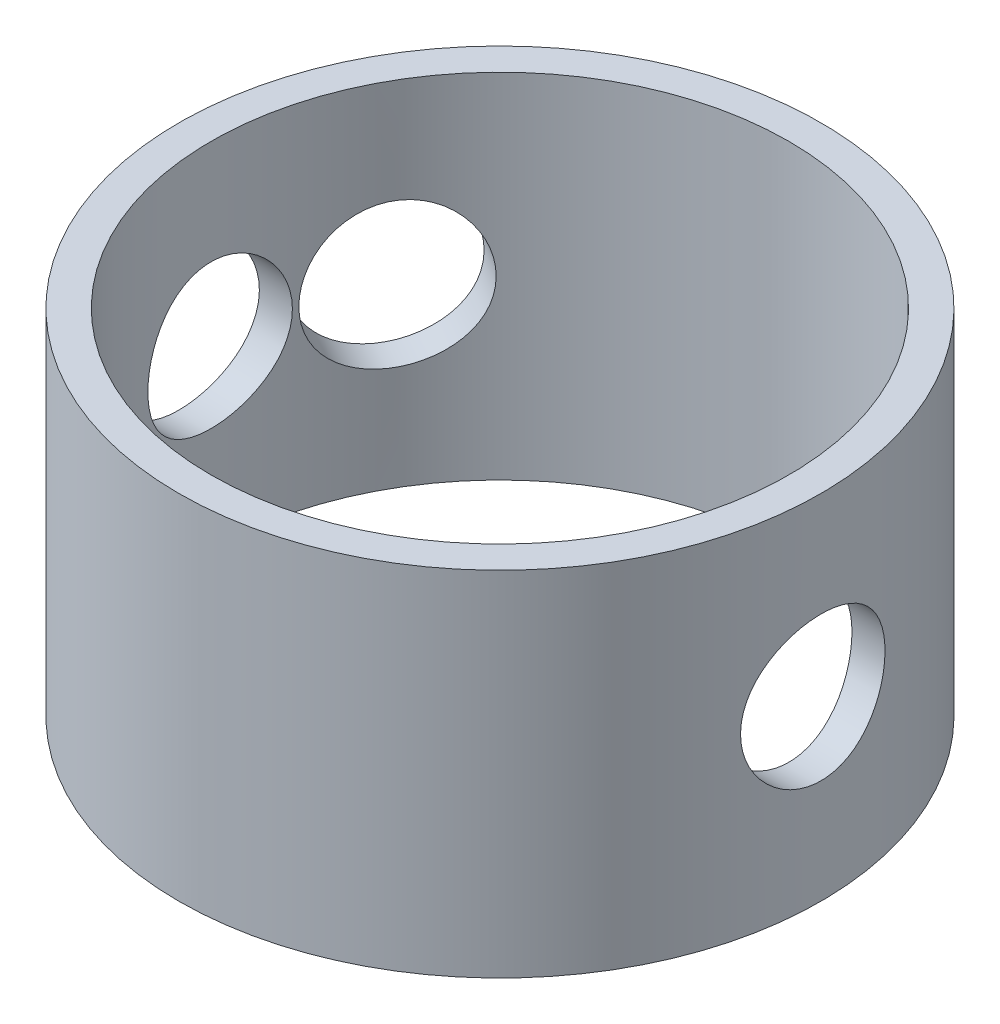
ISO-10303-21;
HEADER;
FILE_DESCRIPTION(('STEP AP214'),'2;1');
FILE_NAME('part.step','',(''),(''),'','','');
FILE_SCHEMA(('AUTOMOTIVE_DESIGN { 1 0 10303 214 1 1 1 1 }'));
ENDSEC;
DATA;
#1=APPLICATION_CONTEXT('core data for automotive mechanical design processes');
#2=APPLICATION_PROTOCOL_DEFINITION('international standard','automotive_design',2000,#1);
#3=PRODUCT_CONTEXT('',#1,'mechanical');
#4=PRODUCT('Part','Part','',(#3));
#5=PRODUCT_RELATED_PRODUCT_CATEGORY('part','',(#4));
#6=PRODUCT_DEFINITION_FORMATION('','',#4);
#7=PRODUCT_DEFINITION_CONTEXT('part definition',#1,'design');
#8=PRODUCT_DEFINITION('design','',#6,#7);
#9=PRODUCT_DEFINITION_SHAPE('','',#8);
#10=(LENGTH_UNIT() NAMED_UNIT(*) SI_UNIT(.MILLI.,.METRE.));
#11=(NAMED_UNIT(*) PLANE_ANGLE_UNIT() SI_UNIT($,.RADIAN.));
#12=(NAMED_UNIT(*) SI_UNIT($,.STERADIAN.) SOLID_ANGLE_UNIT());
#13=UNCERTAINTY_MEASURE_WITH_UNIT(LENGTH_MEASURE(1.E-05),#10,'distance_accuracy_value','');
#14=(GEOMETRIC_REPRESENTATION_CONTEXT(3) GLOBAL_UNCERTAINTY_ASSIGNED_CONTEXT((#13)) GLOBAL_UNIT_ASSIGNED_CONTEXT((#10,
#11,#12)) REPRESENTATION_CONTEXT('',''));
#15=CARTESIAN_POINT('',(0.,0.,0.));
#16=DIRECTION('',(0.,0.,1.));
#17=DIRECTION('',(1.,0.,0.));
#18=AXIS2_PLACEMENT_3D('',#15,#16,#17);
#19=CARTESIAN_POINT('',(0.,5.5,0.));
#20=DIRECTION('',(0.,1.,0.));
#21=DIRECTION('',(0.,0.,1.));
#22=AXIS2_PLACEMENT_3D('',#19,#20,#21);
#23=PLANE('',#22);
#24=CARTESIAN_POINT('',(0.,5.5,0.));
#25=DIRECTION('',(0.,1.,0.));
#26=DIRECTION('',(0.,0.,1.));
#27=AXIS2_PLACEMENT_3D('',#24,#25,#26);
#28=CIRCLE('',#27,10.);
#29=CARTESIAN_POINT('',(0.,5.5,10.));
#30=VERTEX_POINT('',#29);
#31=EDGE_CURVE('E10',#30,#30,#28,.T.);
#32=ORIENTED_EDGE('',*,*,#31,.T.);
#33=EDGE_LOOP('',(#32));
#34=FACE_BOUND('',#33,.T.);
#35=CARTESIAN_POINT('',(0.,5.5,0.));
#36=DIRECTION('',(0.,1.,0.));
#37=DIRECTION('',(0.,0.,1.));
#38=AXIS2_PLACEMENT_3D('',#35,#36,#37);
#39=CIRCLE('',#38,9.);
#40=CARTESIAN_POINT('',(0.,5.5,9.));
#41=VERTEX_POINT('',#40);
#42=EDGE_CURVE('E49',#41,#41,#39,.T.);
#43=ORIENTED_EDGE('',*,*,#42,.F.);
#44=EDGE_LOOP('',(#43));
#45=FACE_BOUND('',#44,.T.);
#46=ADVANCED_FACE('F31',(#34,#45),#23,.T.);
#47=CARTESIAN_POINT('',(0.,-5.5,0.));
#48=DIRECTION('',(0.,1.,0.));
#49=DIRECTION('',(0.,0.,1.));
#50=AXIS2_PLACEMENT_3D('',#47,#48,#49);
#51=PLANE('',#50);
#52=CARTESIAN_POINT('',(0.,-5.5,0.));
#53=DIRECTION('',(0.,1.,0.));
#54=DIRECTION('',(0.,0.,1.));
#55=AXIS2_PLACEMENT_3D('',#52,#53,#54);
#56=CIRCLE('',#55,10.);
#57=CARTESIAN_POINT('',(0.,-5.5,10.));
#58=VERTEX_POINT('',#57);
#59=EDGE_CURVE('E44',#58,#58,#56,.T.);
#60=ORIENTED_EDGE('',*,*,#59,.F.);
#61=EDGE_LOOP('',(#60));
#62=FACE_BOUND('',#61,.T.);
#63=CARTESIAN_POINT('',(0.,-5.5,0.));
#64=DIRECTION('',(0.,1.,0.));
#65=DIRECTION('',(0.,0.,1.));
#66=AXIS2_PLACEMENT_3D('',#63,#64,#65);
#67=CIRCLE('',#66,9.);
#68=CARTESIAN_POINT('',(0.,-5.5,9.));
#69=VERTEX_POINT('',#68);
#70=EDGE_CURVE('E52',#69,#69,#67,.T.);
#71=ORIENTED_EDGE('',*,*,#70,.T.);
#72=EDGE_LOOP('',(#71));
#73=FACE_BOUND('',#72,.T.);
#74=ADVANCED_FACE('F107',(#62,#73),#51,.F.);
#75=CARTESIAN_POINT('',(0.,5.5,0.));
#76=DIRECTION('',(0.,-1.,0.));
#77=DIRECTION('',(0.,0.,-1.));
#78=AXIS2_PLACEMENT_3D('',#75,#76,#77);
#79=CYLINDRICAL_SURFACE('',#78,10.);
#80=CARTESIAN_POINT('',(-10.,-2.25,0.));
#81=CARTESIAN_POINT('',(-9.99999771694518,-2.24999587078108,-0.124699980173304));
#82=CARTESIAN_POINT('',(-9.99764387141181,-2.2395982953768,-0.249449090211301));
#83=CARTESIAN_POINT('',(-9.9884813966466,-2.19832951041739,-0.495397749746435));
#84=CARTESIAN_POINT('',(-9.9816697099651,-2.16744424900414,-0.616594803385697));
#85=CARTESIAN_POINT('',(-9.96434919694451,-2.08622125907406,-0.851849872654528));
#86=CARTESIAN_POINT('',(-9.95384434542968,-2.0359044383554,-0.965915408843231));
#87=CARTESIAN_POINT('',(-9.93026839001207,-1.91731441158288,-1.18398243160764));
#88=CARTESIAN_POINT('',(-9.91719732262225,-1.84904146101007,-1.28798406134451));
#89=CARTESIAN_POINT('',(-9.88967110046879,-1.69525502679128,-1.48473408395884));
#90=CARTESIAN_POINT('',(-9.87519795610526,-1.60949570009561,-1.57728781649952));
#91=CARTESIAN_POINT('',(-9.8466241340422,-1.42369841608187,-1.74682611866484));
#92=CARTESIAN_POINT('',(-9.83252349122492,-1.32365912711958,-1.82380923466833));
#93=CARTESIAN_POINT('',(-9.80611312139272,-1.1106886380241,-1.96089062994942));
#94=CARTESIAN_POINT('',(-9.79382640798822,-0.997619652513677,-2.0207796762197));
#95=CARTESIAN_POINT('',(-9.77269409851722,-0.762699838887984,-2.12063014285829));
#96=CARTESIAN_POINT('',(-9.7638480651916,-0.640850129006192,-2.16059409559087));
#97=CARTESIAN_POINT('',(-9.75078225790901,-0.393945077725128,-2.2188126339931));
#98=CARTESIAN_POINT('',(-9.74648890346122,-0.268975229377931,-2.237412923577));
#99=CARTESIAN_POINT('',(-9.74279372340889,-0.0176207324970899,-2.25345144263654));
#100=CARTESIAN_POINT('',(-9.74339126020144,0.108763729474717,-2.25089243055212));
#101=CARTESIAN_POINT('',(-9.7493438221449,0.35677500839379,-2.22496273321229));
#102=CARTESIAN_POINT('',(-9.75460659824395,0.478446565475752,-2.20199557166843));
#103=CARTESIAN_POINT('',(-9.76915058701734,0.716164082748739,-2.13654167024627));
#104=CARTESIAN_POINT('',(-9.77843203686247,0.832209710463741,-2.0940537783005));
#105=CARTESIAN_POINT('',(-9.80005729379312,1.05650562440403,-1.99039912002163));
#106=CARTESIAN_POINT('',(-9.8124261019186,1.16468246903344,-1.92907886854504));
#107=CARTESIAN_POINT('',(-9.83881732813755,1.36935943001856,-1.78960795010145));
#108=CARTESIAN_POINT('',(-9.85283998387547,1.46585786423543,-1.71145486305659));
#109=CARTESIAN_POINT('',(-9.88135331942439,1.64676002262606,-1.53840941447694));
#110=CARTESIAN_POINT('',(-9.89584735926513,1.73083578516287,-1.44317439868844));
#111=CARTESIAN_POINT('',(-9.92337817561626,1.88187798698242,-1.23979023032877));
#112=CARTESIAN_POINT('',(-9.93641492265959,1.94884408033572,-1.13164081671453));
#113=CARTESIAN_POINT('',(-9.9596085297879,2.06385442564537,-0.905084686036906));
#114=CARTESIAN_POINT('',(-9.96975853624758,2.11185375057136,-0.786654415509773));
#115=CARTESIAN_POINT('',(-9.98598436481004,2.18717808536306,-0.543129505070469));
#116=CARTESIAN_POINT('',(-9.99206081464266,2.21450628070668,-0.418035895178883));
#117=CARTESIAN_POINT('',(-9.99936485032445,2.24723107008369,-0.167546638635216));
#118=CARTESIAN_POINT('',(-10.0006914083681,2.25307538769192,-0.0422122904927544));
#119=CARTESIAN_POINT('',(-9.998624405112,2.24388280727281,0.207642012862522));
#120=CARTESIAN_POINT('',(-9.99523118361733,2.22884741250097,0.332162026055726));
#121=CARTESIAN_POINT('',(-9.98416853819685,2.17869311915451,0.575355741580678));
#122=CARTESIAN_POINT('',(-9.97654952458062,2.14381085342044,0.694080742417265));
#123=CARTESIAN_POINT('',(-9.95788891115751,2.05521709888024,0.9239935007677));
#124=CARTESIAN_POINT('',(-9.94684700837049,2.00150394318563,1.03518058999426));
#125=CARTESIAN_POINT('',(-9.92232244804704,1.87585280628475,1.24869945121971));
#126=CARTESIAN_POINT('',(-9.90880573869581,1.80365412939586,1.35087381002615));
#127=CARTESIAN_POINT('',(-9.8808971094203,1.64342272060557,1.5418171847585));
#128=CARTESIAN_POINT('',(-9.86650506892447,1.55538780407373,1.63058434803184));
#129=CARTESIAN_POINT('',(-9.83812317322868,1.36392321097715,1.79397825629388));
#130=CARTESIAN_POINT('',(-9.82414670937266,1.26022586804994,1.86829411913197));
#131=CARTESIAN_POINT('',(-9.79849887314339,1.04156031811999,1.99845908651711));
#132=CARTESIAN_POINT('',(-9.78682739936824,0.926592607260111,2.05430900349706));
#133=CARTESIAN_POINT('',(-9.76722644872885,0.689273282785766,2.1455693288797));
#134=CARTESIAN_POINT('',(-9.75927557489345,0.566968571315208,2.1810968796756));
#135=CARTESIAN_POINT('',(-9.74798028769131,0.317921950371438,2.23104191763122));
#136=CARTESIAN_POINT('',(-9.74463508800211,0.191180802116749,2.24546300830367));
#137=CARTESIAN_POINT('',(-9.74298148577602,-0.0600013089167236,2.25262552273881));
#138=CARTESIAN_POINT('',(-9.74455840453851,-0.184427692756016,2.24586054101785));
#139=CARTESIAN_POINT('',(-9.75231090038413,-0.430318309827299,2.2119514057036));
#140=CARTESIAN_POINT('',(-9.75848641660509,-0.551782582240692,2.18480752182386));
#141=CARTESIAN_POINT('',(-9.77468279684128,-0.787881404344379,2.11115577035663));
#142=CARTESIAN_POINT('',(-9.78468859473724,-0.902540705210114,2.06472371114527));
#143=CARTESIAN_POINT('',(-9.80742322558036,-1.12251375516475,1.95387734313721));
#144=CARTESIAN_POINT('',(-9.82015236098498,-1.22782646436923,1.88946103674367));
#145=CARTESIAN_POINT('',(-9.8472390229921,-1.4285411498367,1.74285474963165));
#146=CARTESIAN_POINT('',(-9.86162550918978,-1.52368358555722,1.66031472333599));
#147=CARTESIAN_POINT('',(-9.89021568200379,-1.69892877873713,1.48050834559761));
#148=CARTESIAN_POINT('',(-9.90441932543721,-1.77902804194522,1.38323858216312));
#149=CARTESIAN_POINT('',(-9.93127801911181,-1.92298363561255,1.17510318835927));
#150=CARTESIAN_POINT('',(-9.94390879221351,-1.9865986429252,1.06406732741539));
#151=CARTESIAN_POINT('',(-9.96595299275023,-2.0941606300921,0.832614984311326));
#152=CARTESIAN_POINT('',(-9.97536904379473,-2.13812365749292,0.712206250610561));
#153=CARTESIAN_POINT('',(-9.98829672089429,-2.19754384373666,0.493113147452931));
#154=CARTESIAN_POINT('',(-9.99265771842981,-2.21717645823927,0.395589687899849));
#155=CARTESIAN_POINT('',(-9.99851019685605,-2.24340585990937,0.198721159324828));
#156=CARTESIAN_POINT('',(-10.000001819417,-2.25000329066616,0.0993761804816512));
#157=CARTESIAN_POINT('',(-10.,-2.25,0.));
#158=B_SPLINE_CURVE_WITH_KNOTS('',3,(#80,#81,#82,#83,#84,#85,#86,#87,#88,#89,#90,#91,#92,#93,
#94,#95,#96,#97,#98,#99,#100,#101,#102,#103,#104,#105,#106,#107,#108,#109,#110,#111,#112,#113,
#114,#115,#116,#117,#118,#119,#120,#121,#122,#123,#124,#125,#126,#127,#128,#129,#130,#131,#132,
#133,#134,#135,#136,#137,#138,#139,#140,#141,#142,#143,#144,#145,#146,#147,#148,#149,#150,#151,
#152,#153,#154,#155,#156,#157),.UNSPECIFIED.,.T.,.F.,(4,2,2,2,2,2,2,2,2,2,2,2,2,2,2,2,2,2,2,2,2,
2,2,2,2,2,2,2,2,2,2,2,2,2,2,2,2,2,4),(0.,0.373736106234698,0.747728811688385,1.12132022791483,
1.49490632894446,1.87416011882319,2.2534492982533,2.63719933934683,3.02090059558661,
3.39830126943979,3.77565274409459,4.14570499983861,4.51577909800026,4.88895317842802,
5.26218094641699,5.64396439872406,6.02575556945528,6.40844575317233,6.79107695125827,
7.16568740644777,7.54027089258629,7.91047912717914,8.28072014045199,8.65650159427476,
9.03233492746191,9.41552668316496,9.79870157761228,10.1796449182611,10.5605232127409,
10.9325943469771,11.304660556961,11.6752780659135,12.0459367575248,12.4245075326659,
12.8031661343442,13.1870895339321,13.5706988514769,13.8685521516599,14.1663907454919),.UNSPECIFIED.);
#159=CARTESIAN_POINT('',(-10.,-2.25,0.));
#160=VERTEX_POINT('',#159);
#161=EDGE_CURVE('E79',#160,#160,#158,.T.);
#162=ORIENTED_EDGE('',*,*,#161,.T.);
#163=EDGE_LOOP('',(#162));
#164=FACE_BOUND('',#163,.T.);
#165=CARTESIAN_POINT('',(9.74358763495254,0.,-2.25));
#166=CARTESIAN_POINT('',(9.74359014970083,-0.12465493713428,-2.24999583947943));
#167=CARTESIAN_POINT('',(9.74600587019631,-0.249359079583871,-2.23960551864261));
#168=CARTESIAN_POINT('',(9.75538868577708,-0.495214406159011,-2.19836815743239));
#169=CARTESIAN_POINT('',(9.76235894789331,-0.616363056652703,-2.16750688221769));
#170=CARTESIAN_POINT('',(9.78002237082416,-0.851515548645589,-2.08635400208704));
#171=CARTESIAN_POINT('',(9.79071130914383,-0.965527321432348,-2.03608442789582));
#172=CARTESIAN_POINT('',(9.81460259962033,-1.18350349700749,-1.91760581557624));
#173=CARTESIAN_POINT('',(9.82780493079433,-1.2874679836638,-1.84939692721082));
#174=CARTESIAN_POINT('',(9.85549903665696,-1.48425674436178,-1.69567654866098));
#175=CARTESIAN_POINT('',(9.87000811245196,-1.57687532789459,-1.60990480915542));
#176=CARTESIAN_POINT('',(9.89852970621588,-1.74653970570839,-1.42405506445542));
#177=CARTESIAN_POINT('',(9.91254218410064,-1.82358424524172,-1.32397590766918));
#178=CARTESIAN_POINT('',(9.93868076229402,-1.96073251599313,-1.1109673245557));
#179=CARTESIAN_POINT('',(9.950784065854,-2.02063759577535,-0.997906955654935));
#180=CARTESIAN_POINT('',(9.97154477868448,-2.12052004223792,-0.763005710649612));
#181=CARTESIAN_POINT('',(9.98020259753511,-2.16049977767543,-0.641165880233716));
#182=CARTESIAN_POINT('',(9.99297457003381,-2.21874744169933,-0.394304193441953));
#183=CARTESIAN_POINT('',(9.99716154621383,-2.23736373228074,-0.269368365510213));
#184=CARTESIAN_POINT('',(10.000772662194,-2.25344606136175,-0.0180814531885601));
#185=CARTESIAN_POINT('',(10.0001973772397,-2.25091465434498,0.108269458428569));
#186=CARTESIAN_POINT('',(9.99440416997914,-2.22503120587374,0.356395632291741));
#187=CARTESIAN_POINT('',(9.98927000035897,-2.20205475073033,0.478212318524264));
#188=CARTESIAN_POINT('',(9.9750317145991,-2.13653291848458,0.716215174786588));
#189=CARTESIAN_POINT('',(9.96592741226151,-2.09398662355818,0.832401080450657));
#190=CARTESIAN_POINT('',(9.94463838196142,-1.99020610273303,1.05687674309831));
#191=CARTESIAN_POINT('',(9.93243058557695,-1.92883118346861,1.16509917671437));
#192=CARTESIAN_POINT('',(9.90627047285625,-1.78924085447851,1.3698446731545));
#193=CARTESIAN_POINT('',(9.89231790615101,-1.71102302668352,1.46636605299174));
#194=CARTESIAN_POINT('',(9.86383762387237,-1.53792819802948,1.64720476904414));
#195=CARTESIAN_POINT('',(9.84930400812898,-1.44272253138736,1.73120687331084));
#196=CARTESIAN_POINT('',(9.82158596720638,-1.23942444705809,1.88211397959163));
#197=CARTESIAN_POINT('',(9.80840158304563,-1.13133163780054,1.94901846190742));
#198=CARTESIAN_POINT('',(9.78485802013293,-0.904797503492762,2.06398269316304));
#199=CARTESIAN_POINT('',(9.77450826729007,-0.786323340642461,2.11197979640573));
#200=CARTESIAN_POINT('',(9.75793419845763,-0.542702107619626,2.18728657822245));
#201=CARTESIAN_POINT('',(9.75170918571296,-0.417556168310907,2.21459975085748));
#202=CARTESIAN_POINT('',(9.74423235024912,-0.167032460047606,2.24726797888054));
#203=CARTESIAN_POINT('',(9.74287628318979,-0.0417177608843139,2.25308338399437));
#204=CARTESIAN_POINT('',(9.74500918390387,0.208090589776521,2.24384001785704));
#205=CARTESIAN_POINT('',(9.74849779782318,0.332584300571535,2.22878277113847));
#206=CARTESIAN_POINT('',(9.75982825885123,0.575593823199035,2.17862178112616));
#207=CARTESIAN_POINT('',(9.76761441853196,0.69416537233223,2.14377431501384));
#208=CARTESIAN_POINT('',(9.78661192924552,0.923786432944827,2.0553008160828));
#209=CARTESIAN_POINT('',(9.7978236236396,1.03483518900707,2.00167290071165));
#210=CARTESIAN_POINT('',(9.82263613266839,1.24824266005728,1.87615632667619));
#211=CARTESIAN_POINT('',(9.83627273871581,1.35043127036218,1.80398567288353));
#212=CARTESIAN_POINT('',(9.86430547065202,1.54141619858605,1.64379886466324));
#213=CARTESIAN_POINT('',(9.878701696453,1.63021074883814,1.55578062212344));
#214=CARTESIAN_POINT('',(9.90697705878081,1.7936886208323,1.36430826037001));
#215=CARTESIAN_POINT('',(9.92084027992924,1.86805719245284,1.26058265370263));
#216=CARTESIAN_POINT('',(9.94618846175428,1.99831462326587,1.04184410580638));
#217=CARTESIAN_POINT('',(9.95767353676427,2.05420437093602,0.92683170760102));
#218=CARTESIAN_POINT('',(9.97690459087043,2.14548669792765,0.689520876825789));
#219=CARTESIAN_POINT('',(9.9846749498056,2.18101323714257,0.567276038448168));
#220=CARTESIAN_POINT('',(9.99570675097453,2.23097643923395,0.318357687912381));
#221=CARTESIAN_POINT('',(9.99896888897544,2.24541635649103,0.191684862233335));
#222=CARTESIAN_POINT('',(10.0005945519274,2.25264299938778,-0.0595119029764088));
#223=CARTESIAN_POINT('',(9.99906414456862,2.24589856299768,-0.184021896799827));
#224=CARTESIAN_POINT('',(9.99150544104513,2.21200143103687,-0.430085295156806));
#225=CARTESIAN_POINT('',(9.98547723506242,2.18484914464882,-0.551638758919112));
#226=CARTESIAN_POINT('',(9.96960979622924,2.11113718163774,-0.787951349552583));
#227=CARTESIAN_POINT('',(9.95978432500258,2.06464753941443,-0.902733305103031));
#228=CARTESIAN_POINT('',(9.93736861400647,1.95364750601892,-1.12292829761308));
#229=CARTESIAN_POINT('',(9.92477808936174,1.8891352578444,-1.22834036764797));
#230=CARTESIAN_POINT('',(9.89788896627624,1.74241134280584,-1.42907855307012));
#231=CARTESIAN_POINT('',(9.88356129144448,1.65987210581908,-1.5241613644906));
#232=CARTESIAN_POINT('',(9.85496405606879,1.48009332171485,-1.69928665198815));
#233=CARTESIAN_POINT('',(9.84069451049126,1.38285020761072,-1.77932546797319));
#234=CARTESIAN_POINT('',(9.81360024796413,1.17474714285077,-1.92320057007167));
#235=CARTESIAN_POINT('',(9.80079917162417,1.06371199676088,-1.98678817838449));
#236=CARTESIAN_POINT('',(9.77839198535867,0.832264384714451,-2.09429912739728));
#237=CARTESIAN_POINT('',(9.76878324351739,0.711859745022749,-2.13823867730363));
#238=CARTESIAN_POINT('',(9.75557392067199,0.492825536248246,-2.19760544250056));
#239=CARTESIAN_POINT('',(9.75110962550751,0.395360045797478,-2.21721478432225));
#240=CARTESIAN_POINT('',(9.74511556096745,0.198606715730868,-2.24341336497733));
#241=CARTESIAN_POINT('',(9.74358563132372,0.0993189759410581,-2.25000331489993));
#242=CARTESIAN_POINT('',(9.74358763495254,0.,-2.25));
#243=B_SPLINE_CURVE_WITH_KNOTS('',3,(#165,#166,#167,#168,#169,#170,#171,#172,#173,#174,#175,
#176,#177,#178,#179,#180,#181,#182,#183,#184,#185,#186,#187,#188,#189,#190,#191,#192,#193,#194,
#195,#196,#197,#198,#199,#200,#201,#202,#203,#204,#205,#206,#207,#208,#209,#210,#211,#212,#213,
#214,#215,#216,#217,#218,#219,#220,#221,#222,#223,#224,#225,#226,#227,#228,#229,#230,#231,#232,
#233,#234,#235,#236,#237,#238,#239,#240,#241,#242),.UNSPECIFIED.,.T.,.F.,(4,2,2,2,2,2,2,2,2,2,2,
2,2,2,2,2,2,2,2,2,2,2,2,2,2,2,2,2,2,2,2,2,2,2,2,2,2,2,4),(0.,0.37360068321205,0.747461429010009,
1.12089904026706,1.49433353405061,1.87376445216186,2.25322592755654,2.63692212096272,
3.02057268905775,3.39787417630111,3.77513008900697,4.14559549062183,4.51607826880895,
4.88939977173563,5.26277490672007,5.64436489931667,6.02596648932099,6.40882201190648,
6.7916128456685,7.1661575467213,7.54067489257641,7.91044946967034,8.28026112358674,
8.65606921440563,9.03192685878778,9.41523792815891,9.7985305649247,10.1792718741986,
10.5599544159687,10.9322717825488,11.3045816842686,11.6755547669031,12.0465660877438,
12.4249825862442,12.8034910318269,13.1874247243883,13.571041093279,13.8687241607271,
14.1663909689621),.UNSPECIFIED.);
#244=CARTESIAN_POINT('',(9.74358763495254,0.,-2.25));
#245=VERTEX_POINT('',#244);
#246=EDGE_CURVE('E75',#245,#245,#243,.T.);
#247=ORIENTED_EDGE('',*,*,#246,.T.);
#248=EDGE_LOOP('',(#247));
#249=FACE_BOUND('',#248,.T.);
#250=CARTESIAN_POINT('',(-9.56319441586885,0.,-2.92323665896122));
#251=CARTESIAN_POINT('',(-9.56319451344447,0.12465493713428,-2.92324151945188));
#252=CARTESIAN_POINT('',(-9.56009142834359,0.249359079583871,-2.93344766149778));
#253=CARTESIAN_POINT('',(-9.54759850439045,0.49521440615901,-2.97385167168125));
#254=CARTESIAN_POINT('',(-9.5382042908468,0.616363056652702,-3.00406345106847));
#255=CARTESIAN_POINT('',(-9.51292482375737,0.851515548645588,-3.08317561831731));
#256=CARTESIAN_POINT('',(-9.49704692878608,0.965527321432347,-3.13205481576417));
#257=CARTESIAN_POINT('',(-9.45849808710814,1.18350349700749,-3.24660594907631));
#258=CARTESIAN_POINT('',(-9.43582719711129,1.2874679836638,-3.31227774475166));
#259=CARTESIAN_POINT('',(-9.3829508070485,1.48425674436178,-3.45925055058649));
#260=CARTESIAN_POINT('',(-9.35263016551963,1.57687532789459,-3.54078559382259));
#261=CARTESIAN_POINT('',(-9.2844057179256,1.74653970570839,-3.7159969909016));
#262=CARTESIAN_POINT('',(-9.24650130135065,1.82358424524172,-3.8096743220102));
#263=CARTESIAN_POINT('',(-9.16263368252818,1.96073251599313,-4.00721445530729));
#264=CARTESIAN_POINT('',(-9.11658526643046,2.02063759577535,-4.11117925871658));
#265=CARTESIAN_POINT('',(-9.01711394863967,2.12052004223792,-4.32499006068702));
#266=CARTESIAN_POINT('',(-8.96369192449773,2.16049977767543,-4.43483535844529));
#267=CARTESIAN_POINT('',(-8.85132193374216,2.21874744169933,-4.65500983667738));
#268=CARTESIAN_POINT('',(-8.79248004751323,2.23736373228074,-4.76530092559912));
#269=CARTESIAN_POINT('',(-8.66996390952724,2.25344606136175,-4.98472733329831));
#270=CARTESIAN_POINT('',(-8.60629024233387,2.25091465434498,-5.09386279007294));
#271=CARTESIAN_POINT('',(-8.47721009074522,2.22503120587374,-5.30584975635198));
#272=CARTESIAN_POINT('',(-8.41185542631056,2.20205475073033,-5.4087790164241));
#273=CARTESIAN_POINT('',(-8.28052328100501,2.13653291848458,-5.6077763932406));
#274=CARTESIAN_POINT('',(-8.21454577106488,2.09398662355818,-5.70384418793859));
#275=CARTESIAN_POINT('',(-8.08387109867925,1.99020610273303,-5.88760129917276));
#276=CARTESIAN_POINT('',(-8.01918762007804,1.92883118346861,-5.97522077775141));
#277=CARTESIAN_POINT('',(-7.89415954967598,1.78924085447851,-6.13945552261866));
#278=CARTESIAN_POINT('',(-7.83381558254262,1.71102302668352,-6.21606920621342));
#279=CARTESIAN_POINT('',(-7.71873157655618,1.53792819802948,-6.35843998716324));
#280=CARTESIAN_POINT('',(-7.66414404398021,1.44272253138736,-6.42392113555786));
#281=CARTESIAN_POINT('',(-7.5646859632577,1.23942444705809,-6.54075150274733));
#282=CARTESIAN_POINT('',(-7.51981571048335,1.13133163780054,-6.59210029197947));
#283=CARTESIAN_POINT('',(-7.44194427127754,0.904797503492761,-6.67989045531704));
#284=CARTESIAN_POINT('',(-7.40898257077139,0.78632334064246,-6.71628228961184));
#285=CARTESIAN_POINT('',(-7.35697561521007,0.542702107619626,-6.77321284132615));
#286=CARTESIAN_POINT('',(-7.33792800971679,0.417556168310907,-6.7937542363137));
#287=CARTESIAN_POINT('',(-7.31511876625366,0.167032460047607,-6.81830733394637));
#288=CARTESIAN_POINT('',(-7.31103667517413,0.0417177608843148,-6.82266558897858));
#289=CARTESIAN_POINT('',(-7.31750550444493,-0.20809058977652,-6.81572704944421));
#290=CARTESIAN_POINT('',(-7.32805535608233,-0.332584300571535,-6.80443139823454));
#291=CARTESIAN_POINT('',(-7.36294831817537,-0.575593823199035,-6.76665593711893));
#292=CARTESIAN_POINT('',(-7.38711506331297,-0.694165372332231,-6.7403702260485));
#293=CARTESIAN_POINT('',(-7.44780413966509,-0.923786432944827,-6.67324868376931));
#294=CARTESIAN_POINT('',(-7.48432770951541,-1.03483518900707,-6.63241139390293));
#295=CARTESIAN_POINT('',(-7.56857425968371,-1.24824266005728,-6.53611710670663));
#296=CARTESIAN_POINT('',(-7.6164692338385,-1.35043127036218,-6.48043379013816));
#297=CARTESIAN_POINT('',(-7.72083969594287,-1.54141619858605,-6.35572431083635));
#298=CARTESIAN_POINT('',(-7.77731631447505,-1.63021074883814,-6.28669638970091));
#299=CARTESIAN_POINT('',(-7.89753967742885,-1.7936886208323,-6.13501414146374));
#300=CARTESIAN_POINT('',(-7.96140838245536,-1.86805719245284,-6.05211674164105));
#301=CARTESIAN_POINT('',(-8.09272982580372,-1.99831462326587,-5.8753576932885));
#302=CARTESIAN_POINT('',(-8.16018239162942,-2.05420437093602,-5.78149657219748));
#303=CARTESIAN_POINT('',(-8.29549238841452,-2.14548669792765,-5.58559489120602));
#304=CARTESIAN_POINT('',(-8.36334413583771,-2.18101323714257,-5.48361293515706));
#305=CARTESIAN_POINT('',(-8.49735713116739,-2.23097643923395,-5.27355922070941));
#306=CARTESIAN_POINT('',(-8.56351863838636,-2.24541635649103,-5.16548840470266));
#307=CARTESIAN_POINT('',(-8.69052488640557,-2.25264299938778,-4.9487584561585));
#308=CARTESIAN_POINT('',(-8.75145451166648,-2.24589856299769,-4.84016443480301));
#309=CARTESIAN_POINT('',(-8.86794018157395,-2.21200143103687,-4.62328792912259));
#310=CARTESIAN_POINT('',(-8.92349633393483,-2.18484914464882,-4.51500543859508));
#311=CARTESIAN_POINT('',(-9.02791102412904,-2.11113718163775,-4.3024190124558));
#312=CARTESIAN_POINT('',(-9.07679289421782,-2.06464753941443,-4.19810218743972));
#313=CARTESIAN_POINT('',(-9.16747781530633,-1.95364750601892,-3.99619987464184));
#314=CARTESIAN_POINT('',(-9.20928013613446,-1.8891352578444,-3.89861508180375));
#315=CARTESIAN_POINT('',(-9.28636256516801,-1.74241134280584,-3.71132615217583));
#316=CARTESIAN_POINT('',(-9.32149584049677,-1.65987210581907,-3.62181818460657));
#317=CARTESIAN_POINT('',(-9.38429255193219,-1.48009332171485,-3.45585661910079));
#318=CARTESIAN_POINT('',(-9.41195417095412,-1.38285020761072,-3.37940619838016));
#319=CARTESIAN_POINT('',(-9.46042740235806,-1.17474714285078,-3.24125957372722));
#320=CARTESIAN_POINT('',(-9.48113514920828,-1.06371199676088,-3.17979055139245));
#321=CARTESIAN_POINT('',(-9.51548543118142,-0.832264384714452,-3.07547974522965));
#322=CARTESIAN_POINT('',(-9.52913379160164,-0.711859745022751,-3.03262260785926));
#323=CARTESIAN_POINT('',(-9.5473775650492,-0.492825536248246,-2.97460481963551));
#324=CARTESIAN_POINT('',(-9.55331604293761,-0.395360045797477,-2.95539048388419));
#325=CARTESIAN_POINT('',(-9.56122432110153,-0.198606715730867,-2.92970481522376));
#326=CARTESIAN_POINT('',(-9.56319433812536,-0.0993189759410577,-2.92323278635926));
#327=CARTESIAN_POINT('',(-9.56319441586885,0.,-2.92323665896122));
#328=B_SPLINE_CURVE_WITH_KNOTS('',3,(#250,#251,#252,#253,#254,#255,#256,#257,#258,#259,#260,
#261,#262,#263,#264,#265,#266,#267,#268,#269,#270,#271,#272,#273,#274,#275,#276,#277,#278,#279,
#280,#281,#282,#283,#284,#285,#286,#287,#288,#289,#290,#291,#292,#293,#294,#295,#296,#297,#298,
#299,#300,#301,#302,#303,#304,#305,#306,#307,#308,#309,#310,#311,#312,#313,#314,#315,#316,#317,
#318,#319,#320,#321,#322,#323,#324,#325,#326,#327),.UNSPECIFIED.,.T.,.F.,(4,2,2,2,2,2,2,2,2,2,2,
2,2,2,2,2,2,2,2,2,2,2,2,2,2,2,2,2,2,2,2,2,2,2,2,2,2,2,4),(0.,0.37360068321205,0.747461429010008,
1.12089904026706,1.49433353405061,1.87376445216185,2.25322592755653,2.63692212096272,
3.02057268905775,3.39787417630111,3.77513008900697,4.14559549062183,4.51607826880895,
4.88939977173563,5.26277490672007,5.64436489931667,6.02596648932099,6.40882201190648,
6.79161284566849,7.1661575467213,7.54067489257641,7.91044946967034,8.28026112358674,
8.65606921440563,9.03192685878778,9.41523792815891,9.7985305649247,10.1792718741986,
10.5599544159687,10.9322717825488,11.3045816842686,11.6755547669031,12.0465660877438,
12.4249825862442,12.8034910318269,13.1874247243883,13.571041093279,13.8687241607271,
14.1663909689621),.UNSPECIFIED.);
#329=CARTESIAN_POINT('',(-9.56319441586885,0.,-2.92323665896122));
#330=VERTEX_POINT('',#329);
#331=EDGE_CURVE('E84',#330,#330,#328,.T.);
#332=ORIENTED_EDGE('',*,*,#331,.F.);
#333=EDGE_LOOP('',(#332));
#334=FACE_BOUND('',#333,.T.);
#335=ORIENTED_EDGE('',*,*,#31,.F.);
#336=EDGE_LOOP('',(#335));
#337=FACE_BOUND('',#336,.T.);
#338=ORIENTED_EDGE('',*,*,#59,.T.);
#339=EDGE_LOOP('',(#338));
#340=FACE_BOUND('',#339,.T.);
#341=ADVANCED_FACE('F33',(#164,#249,#334,#337,#340),#79,.T.);
#342=CARTESIAN_POINT('',(0.,5.5,0.));
#343=DIRECTION('',(0.,-1.,0.));
#344=DIRECTION('',(0.,0.,-1.));
#345=AXIS2_PLACEMENT_3D('',#342,#343,#344);
#346=CYLINDRICAL_SURFACE('',#345,9.);
#347=CARTESIAN_POINT('',(-8.71421252896669,0.,-2.25));
#348=CARTESIAN_POINT('',(-8.71421490079074,0.124245675833919,-2.24999647073377));
#349=CARTESIAN_POINT('',(-8.71689875413137,0.24853040881067,-2.23967362094789));
#350=CARTESIAN_POINT('',(-8.72731675793308,0.493530820356159,-2.19872081291741));
#351=CARTESIAN_POINT('',(-8.73505384759467,0.614244379021367,-2.16807903606789));
#352=CARTESIAN_POINT('',(-8.75464852136535,0.848523184368464,-2.08754207966884));
#353=CARTESIAN_POINT('',(-8.76650078421412,0.962097439847137,-2.03767175506904));
#354=CARTESIAN_POINT('',(-8.79298372825883,1.17927976728589,-1.92016902713525));
#355=CARTESIAN_POINT('',(-8.8076145274064,1.2828874158722,-1.85253586970462));
#356=CARTESIAN_POINT('',(-8.83836644720062,1.47947548073599,-1.69983758458069));
#357=CARTESIAN_POINT('',(-8.85451137860731,1.57220424031504,-1.61445319893365));
#358=CARTESIAN_POINT('',(-8.88626587963764,1.74218525492431,-1.4293638576906));
#359=CARTESIAN_POINT('',(-8.90187539909749,1.81943606305957,-1.32965756476228));
#360=CARTESIAN_POINT('',(-8.93106373968524,1.95729792086815,-1.11703068097106));
#361=CARTESIAN_POINT('',(-8.94461118660533,2.01766174934532,-1.00394511857561));
#362=CARTESIAN_POINT('',(-8.96787730733385,2.11842867973777,-0.768836865863486));
#363=CARTESIAN_POINT('',(-8.9775965460091,2.15883472672396,-0.646815497212746));
#364=CARTESIAN_POINT('',(-8.99194282963362,2.21773305112073,-0.399922882878745));
#365=CARTESIAN_POINT('',(-8.99666904459882,2.23665267989392,-0.275159447594077));
#366=CARTESIAN_POINT('',(-9.00084234696568,2.253382541348,-0.024145937336492));
#367=CARTESIAN_POINT('',(-9.00029021487034,2.25119589498864,0.102103915084262));
#368=CARTESIAN_POINT('',(-8.9940428545818,2.22608263477487,0.349542556137872));
#369=CARTESIAN_POINT('',(-8.98846202106784,2.20361730745153,0.470781485102401));
#370=CARTESIAN_POINT('',(-8.97291752872371,2.13932585695635,0.707711056680794));
#371=CARTESIAN_POINT('',(-8.96295363658607,2.09749870316033,0.823401403583486));
#372=CARTESIAN_POINT('',(-8.93958758730796,1.99529768638164,1.04716508287906));
#373=CARTESIAN_POINT('',(-8.92615517725509,1.93475965980443,1.15516014697463));
#374=CARTESIAN_POINT('',(-8.89730913428722,1.79697988879537,1.3596201502661));
#375=CARTESIAN_POINT('',(-8.88189515687385,1.71973523829544,1.45608307894239));
#376=CARTESIAN_POINT('',(-8.85027342392421,1.54826213221587,1.63749157894115));
#377=CARTESIAN_POINT('',(-8.83405547572767,1.45363059688703,1.72205477791919));
#378=CARTESIAN_POINT('',(-8.80303539165594,1.25136002381375,1.8741968459168));
#379=CARTESIAN_POINT('',(-8.7882333219746,1.14372037845801,1.94177492110356));
#380=CARTESIAN_POINT('',(-8.76168447146387,0.917738969266025,2.05827329030082));
#381=CARTESIAN_POINT('',(-8.74995285345306,0.799347842718477,2.10710152568351));
#382=CARTESIAN_POINT('',(-8.73106776133802,0.555673078730841,2.18404264643186));
#383=CARTESIAN_POINT('',(-8.7239133075846,0.430390922413863,2.21215996474439));
#384=CARTESIAN_POINT('',(-8.71519820406711,0.180036448623073,2.24624667479933));
#385=CARTESIAN_POINT('',(-8.7134948007924,0.0550459859930781,2.25278142652721));
#386=CARTESIAN_POINT('',(-8.71548609028223,-0.194239742926729,2.24506529146364));
#387=CARTESIAN_POINT('',(-8.7191802861327,-0.318535072154498,2.23081631806482));
#388=CARTESIAN_POINT('',(-8.73141373786481,-0.560802838453716,2.18243291754443));
#389=CARTESIAN_POINT('',(-8.73987273218278,-0.678845453912279,2.14862766145371));
#390=CARTESIAN_POINT('',(-8.76060646436524,-0.907588312067995,2.06245627350342));
#391=CARTESIAN_POINT('',(-8.77288165421767,-1.01828768315021,2.01008794294125));
#392=CARTESIAN_POINT('',(-8.8001652338596,-1.23159715008021,1.88709360114294));
#393=CARTESIAN_POINT('',(-8.8152225174652,-1.33400595603868,1.81612957845208));
#394=CARTESIAN_POINT('',(-8.84625374764001,-1.52566952652133,1.65838565910252));
#395=CARTESIAN_POINT('',(-8.86222784455476,-1.6149221249851,1.57160316331224));
#396=CARTESIAN_POINT('',(-8.89377662728596,-1.78002993831383,1.38209112221564));
#397=CARTESIAN_POINT('',(-8.90933131855692,-1.85549405629392,1.27901689319608));
#398=CARTESIAN_POINT('',(-8.93787494952321,-1.98804228025613,1.06133103606302));
#399=CARTESIAN_POINT('',(-8.95086402303554,-2.04512734494739,0.946720010154579));
#400=CARTESIAN_POINT('',(-8.97273104164492,-2.13880143107514,0.710005953894953));
#401=CARTESIAN_POINT('',(-8.98163847020168,-2.17553785594116,0.587964107312734));
#402=CARTESIAN_POINT('',(-8.9944676405621,-2.22791430114757,0.339186960717315));
#403=CARTESIAN_POINT('',(-8.99839034454079,-2.24355839286514,0.21245257134279));
#404=CARTESIAN_POINT('',(-9.00076881169814,-2.25307707654496,-0.0384379344974771));
#405=CARTESIAN_POINT('',(-8.99936952479974,-2.24752884546467,-0.162571110673549));
#406=CARTESIAN_POINT('',(-8.99158267029247,-2.21614238858771,-0.408076866933189));
#407=CARTESIAN_POINT('',(-8.9851952510363,-2.19030476622037,-0.52944952900709));
#408=CARTESIAN_POINT('',(-8.9681722392125,-2.11938250551556,-0.765384830200742));
#409=CARTESIAN_POINT('',(-8.95755970130383,-2.07440223004265,-0.879980612806942));
#410=CARTESIAN_POINT('',(-8.9332040005573,-1.96656619720596,-1.10006336934365));
#411=CARTESIAN_POINT('',(-8.91946044312204,-1.90370818649141,-1.20554919284767));
#412=CARTESIAN_POINT('',(-8.88991311780646,-1.7601407235087,-1.40715433895243));
#413=CARTESIAN_POINT('',(-8.87406788118745,-1.67903967846638,-1.50298872367126));
#414=CARTESIAN_POINT('',(-8.84228960378677,-1.50204858305097,-1.67988379561538));
#415=CARTESIAN_POINT('',(-8.8263565417643,-1.40615478874988,-1.76094073142233));
#416=CARTESIAN_POINT('',(-8.7958682065238,-1.20014681807371,-1.90746455956162));
#417=CARTESIAN_POINT('',(-8.781344182649,-1.08980072242818,-1.97261239368685));
#418=CARTESIAN_POINT('',(-8.75573899863363,-0.859375147781657,-2.08333551731731));
#419=CARTESIAN_POINT('',(-8.74465533524731,-0.739302826288845,-2.12892504694234));
#420=CARTESIAN_POINT('',(-8.72891794689159,-0.516201723370889,-2.19245068928476));
#421=CARTESIAN_POINT('',(-8.72344491757872,-0.414240380131192,-2.21398463384298));
#422=CARTESIAN_POINT('',(-8.71609136810895,-0.208195044755202,-2.24276015828648));
#423=CARTESIAN_POINT('',(-8.71421054150492,-0.104111234450095,-2.25000295733644));
#424=CARTESIAN_POINT('',(-8.71421252896669,0.,-2.25));
#425=B_SPLINE_CURVE_WITH_KNOTS('',3,(#347,#348,#349,#350,#351,#352,#353,#354,#355,#356,#357,
#358,#359,#360,#361,#362,#363,#364,#365,#366,#367,#368,#369,#370,#371,#372,#373,#374,#375,#376,
#377,#378,#379,#380,#381,#382,#383,#384,#385,#386,#387,#388,#389,#390,#391,#392,#393,#394,#395,
#396,#397,#398,#399,#400,#401,#402,#403,#404,#405,#406,#407,#408,#409,#410,#411,#412,#413,#414,
#415,#416,#417,#418,#419,#420,#421,#422,#423,#424),.UNSPECIFIED.,.T.,.F.,(4,2,2,2,2,2,2,2,2,2,2,
2,2,2,2,2,2,2,2,2,2,2,2,2,2,2,2,2,2,2,2,2,2,2,2,2,2,2,4),(0.,0.372354697562523,0.7449261672858,
1.11701765444942,1.48912494079931,1.86861558773679,2.2481416933188,2.63296346758128,
3.01772843862383,3.39469875895812,3.77161333799418,4.14016436420052,4.50873501052307,
4.88063586829,5.25260146922022,5.6346341991472,6.01668478079822,6.40058788807562,
6.78440880116593,7.15809217287784,7.53174114469872,7.89927664512737,8.26685569283726,
8.64164561277692,9.0164971700099,9.40072797873237,9.78493874152048,10.1663286553069,
10.5476449402258,10.9186510151916,11.2896460564373,11.6586438890819,12.0276882516872,
12.4055738692831,12.7835552841341,13.1685882956202,13.5533404923751,13.8653804446715,
14.1773937759712),.UNSPECIFIED.);
#426=CARTESIAN_POINT('',(-8.71421252896669,0.,-2.25));
#427=VERTEX_POINT('',#426);
#428=EDGE_CURVE('E36',#427,#427,#425,.T.);
#429=ORIENTED_EDGE('',*,*,#428,.F.);
#430=EDGE_LOOP('',(#429));
#431=FACE_BOUND('',#430,.T.);
#432=CARTESIAN_POINT('',(8.71421252896669,0.,-2.25));
#433=CARTESIAN_POINT('',(8.71421490079074,-0.124245675833919,-2.24999647073377));
#434=CARTESIAN_POINT('',(8.71689875413137,-0.24853040881067,-2.23967362094789));
#435=CARTESIAN_POINT('',(8.72731675793308,-0.493530820356159,-2.19872081291741));
#436=CARTESIAN_POINT('',(8.73505384759467,-0.614244379021367,-2.16807903606789));
#437=CARTESIAN_POINT('',(8.75464852136535,-0.848523184368464,-2.08754207966884));
#438=CARTESIAN_POINT('',(8.76650078421412,-0.962097439847137,-2.03767175506904));
#439=CARTESIAN_POINT('',(8.79298372825883,-1.17927976728589,-1.92016902713525));
#440=CARTESIAN_POINT('',(8.8076145274064,-1.2828874158722,-1.85253586970462));
#441=CARTESIAN_POINT('',(8.83836644720062,-1.47947548073599,-1.69983758458069));
#442=CARTESIAN_POINT('',(8.85451137860731,-1.57220424031504,-1.61445319893365));
#443=CARTESIAN_POINT('',(8.88626587963764,-1.74218525492431,-1.4293638576906));
#444=CARTESIAN_POINT('',(8.90187539909749,-1.81943606305957,-1.32965756476228));
#445=CARTESIAN_POINT('',(8.93106373968524,-1.95729792086815,-1.11703068097106));
#446=CARTESIAN_POINT('',(8.94461118660533,-2.01766174934532,-1.00394511857561));
#447=CARTESIAN_POINT('',(8.96787730733385,-2.11842867973777,-0.768836865863486));
#448=CARTESIAN_POINT('',(8.9775965460091,-2.15883472672396,-0.646815497212746));
#449=CARTESIAN_POINT('',(8.99194282963362,-2.21773305112073,-0.399922882878745));
#450=CARTESIAN_POINT('',(8.99666904459882,-2.23665267989392,-0.275159447594077));
#451=CARTESIAN_POINT('',(9.00084234696568,-2.253382541348,-0.024145937336492));
#452=CARTESIAN_POINT('',(9.00029021487034,-2.25119589498864,0.102103915084262));
#453=CARTESIAN_POINT('',(8.9940428545818,-2.22608263477487,0.349542556137872));
#454=CARTESIAN_POINT('',(8.98846202106784,-2.20361730745153,0.470781485102401));
#455=CARTESIAN_POINT('',(8.97291752872371,-2.13932585695635,0.707711056680794));
#456=CARTESIAN_POINT('',(8.96295363658607,-2.09749870316033,0.823401403583486));
#457=CARTESIAN_POINT('',(8.93958758730796,-1.99529768638164,1.04716508287906));
#458=CARTESIAN_POINT('',(8.92615517725509,-1.93475965980443,1.15516014697463));
#459=CARTESIAN_POINT('',(8.89730913428722,-1.79697988879537,1.3596201502661));
#460=CARTESIAN_POINT('',(8.88189515687385,-1.71973523829544,1.45608307894239));
#461=CARTESIAN_POINT('',(8.85027342392421,-1.54826213221587,1.63749157894115));
#462=CARTESIAN_POINT('',(8.83405547572767,-1.45363059688703,1.72205477791919));
#463=CARTESIAN_POINT('',(8.80303539165594,-1.25136002381375,1.8741968459168));
#464=CARTESIAN_POINT('',(8.7882333219746,-1.14372037845801,1.94177492110356));
#465=CARTESIAN_POINT('',(8.76168447146387,-0.917738969266025,2.05827329030082));
#466=CARTESIAN_POINT('',(8.74995285345306,-0.799347842718477,2.10710152568351));
#467=CARTESIAN_POINT('',(8.73106776133802,-0.555673078730841,2.18404264643186));
#468=CARTESIAN_POINT('',(8.7239133075846,-0.430390922413863,2.21215996474439));
#469=CARTESIAN_POINT('',(8.71519820406711,-0.180036448623073,2.24624667479933));
#470=CARTESIAN_POINT('',(8.7134948007924,-0.0550459859930781,2.25278142652721));
#471=CARTESIAN_POINT('',(8.71548609028223,0.194239742926729,2.24506529146364));
#472=CARTESIAN_POINT('',(8.7191802861327,0.318535072154498,2.23081631806482));
#473=CARTESIAN_POINT('',(8.73141373786481,0.560802838453716,2.18243291754443));
#474=CARTESIAN_POINT('',(8.73987273218278,0.678845453912279,2.14862766145371));
#475=CARTESIAN_POINT('',(8.76060646436524,0.907588312067995,2.06245627350342));
#476=CARTESIAN_POINT('',(8.77288165421767,1.01828768315021,2.01008794294125));
#477=CARTESIAN_POINT('',(8.8001652338596,1.23159715008021,1.88709360114294));
#478=CARTESIAN_POINT('',(8.8152225174652,1.33400595603868,1.81612957845208));
#479=CARTESIAN_POINT('',(8.84625374764001,1.52566952652133,1.65838565910252));
#480=CARTESIAN_POINT('',(8.86222784455476,1.6149221249851,1.57160316331224));
#481=CARTESIAN_POINT('',(8.89377662728596,1.78002993831383,1.38209112221564));
#482=CARTESIAN_POINT('',(8.90933131855692,1.85549405629392,1.27901689319608));
#483=CARTESIAN_POINT('',(8.93787494952321,1.98804228025613,1.06133103606302));
#484=CARTESIAN_POINT('',(8.95086402303554,2.04512734494739,0.946720010154579));
#485=CARTESIAN_POINT('',(8.97273104164492,2.13880143107514,0.710005953894953));
#486=CARTESIAN_POINT('',(8.98163847020168,2.17553785594116,0.587964107312734));
#487=CARTESIAN_POINT('',(8.9944676405621,2.22791430114757,0.339186960717315));
#488=CARTESIAN_POINT('',(8.99839034454079,2.24355839286514,0.21245257134279));
#489=CARTESIAN_POINT('',(9.00076881169814,2.25307707654496,-0.0384379344974771));
#490=CARTESIAN_POINT('',(8.99936952479974,2.24752884546467,-0.162571110673549));
#491=CARTESIAN_POINT('',(8.99158267029247,2.21614238858771,-0.408076866933189));
#492=CARTESIAN_POINT('',(8.9851952510363,2.19030476622037,-0.52944952900709));
#493=CARTESIAN_POINT('',(8.9681722392125,2.11938250551556,-0.765384830200742));
#494=CARTESIAN_POINT('',(8.95755970130383,2.07440223004265,-0.879980612806942));
#495=CARTESIAN_POINT('',(8.9332040005573,1.96656619720596,-1.10006336934365));
#496=CARTESIAN_POINT('',(8.91946044312204,1.90370818649141,-1.20554919284767));
#497=CARTESIAN_POINT('',(8.88991311780646,1.7601407235087,-1.40715433895243));
#498=CARTESIAN_POINT('',(8.87406788118745,1.67903967846638,-1.50298872367126));
#499=CARTESIAN_POINT('',(8.84228960378677,1.50204858305097,-1.67988379561538));
#500=CARTESIAN_POINT('',(8.8263565417643,1.40615478874988,-1.76094073142233));
#501=CARTESIAN_POINT('',(8.7958682065238,1.20014681807371,-1.90746455956162));
#502=CARTESIAN_POINT('',(8.781344182649,1.08980072242818,-1.97261239368685));
#503=CARTESIAN_POINT('',(8.75573899863363,0.859375147781657,-2.08333551731731));
#504=CARTESIAN_POINT('',(8.74465533524731,0.739302826288845,-2.12892504694234));
#505=CARTESIAN_POINT('',(8.72891794689159,0.516201723370889,-2.19245068928476));
#506=CARTESIAN_POINT('',(8.72344491757872,0.414240380131192,-2.21398463384298));
#507=CARTESIAN_POINT('',(8.71609136810895,0.208195044755202,-2.24276015828648));
#508=CARTESIAN_POINT('',(8.71421054150492,0.104111234450095,-2.25000295733644));
#509=CARTESIAN_POINT('',(8.71421252896669,0.,-2.25));
#510=B_SPLINE_CURVE_WITH_KNOTS('',3,(#432,#433,#434,#435,#436,#437,#438,#439,#440,#441,#442,
#443,#444,#445,#446,#447,#448,#449,#450,#451,#452,#453,#454,#455,#456,#457,#458,#459,#460,#461,
#462,#463,#464,#465,#466,#467,#468,#469,#470,#471,#472,#473,#474,#475,#476,#477,#478,#479,#480,
#481,#482,#483,#484,#485,#486,#487,#488,#489,#490,#491,#492,#493,#494,#495,#496,#497,#498,#499,
#500,#501,#502,#503,#504,#505,#506,#507,#508,#509),.UNSPECIFIED.,.T.,.F.,(4,2,2,2,2,2,2,2,2,2,2,
2,2,2,2,2,2,2,2,2,2,2,2,2,2,2,2,2,2,2,2,2,2,2,2,2,2,2,4),(0.,0.372354697562523,0.7449261672858,
1.11701765444942,1.48912494079931,1.86861558773679,2.2481416933188,2.63296346758128,
3.01772843862383,3.39469875895812,3.77161333799418,4.14016436420052,4.50873501052307,
4.88063586829,5.25260146922022,5.6346341991472,6.01668478079822,6.40058788807562,
6.78440880116593,7.15809217287784,7.53174114469872,7.89927664512737,8.26685569283726,
8.64164561277692,9.0164971700099,9.40072797873237,9.78493874152048,10.1663286553069,
10.5476449402258,10.9186510151916,11.2896460564373,11.6586438890819,12.0276882516872,
12.4055738692831,12.7835552841341,13.1685882956202,13.5533404923751,13.8653804446715,
14.1773937759712),.UNSPECIFIED.);
#511=CARTESIAN_POINT('',(8.71421252896669,0.,-2.25));
#512=VERTEX_POINT('',#511);
#513=EDGE_CURVE('E54',#512,#512,#510,.T.);
#514=ORIENTED_EDGE('',*,*,#513,.F.);
#515=EDGE_LOOP('',(#514));
#516=FACE_BOUND('',#515,.T.);
#517=CARTESIAN_POINT('',(-8.6717294240618,0.,-2.4085491059683));
#518=CARTESIAN_POINT('',(-8.67172971348857,0.124245675833919,-2.40855334831455));
#519=CARTESIAN_POINT('',(-8.66889257376865,0.24853040881067,-2.41883512513889));
#520=CARTESIAN_POINT('',(-8.65743842570241,0.493530820356158,-2.45951029915043));
#521=CARTESIAN_POINT('',(-8.64881805347595,0.614244379021367,-2.48991540115001));
#522=CARTESIAN_POINT('',(-8.6255190605407,0.848523184368464,-2.56945978822041));
#523=CARTESIAN_POINT('',(-8.61084825896017,0.962097439847138,-2.61857488764319));
#524=CARTESIAN_POINT('',(-8.57503179730299,1.17927976728589,-2.73357670707019));
#525=CARTESIAN_POINT('',(-8.55388586232714,1.2828874158722,-2.79946413911705));
#526=CARTESIAN_POINT('',(-8.50416866352212,1.47947548073599,-2.9470806930458));
#527=CARTESIAN_POINT('',(-8.47545839143914,1.57220424031504,-3.02909820580601));
#528=CARTESIAN_POINT('',(-8.41041392539439,1.74218525492431,-3.20526752780739));
#529=CARTESIAN_POINT('',(-8.37407901932333,1.81943606305957,-3.29942047013041));
#530=CARTESIAN_POINT('',(-8.29304342187102,1.95729792086815,-3.498154923315));
#531=CARTESIAN_POINT('',(-8.24823307386252,2.01766174934532,-3.60286361661076));
#532=CARTESIAN_POINT('',(-8.15082799910487,2.11842867973777,-3.81810639646309));
#533=CARTESIAN_POINT('',(-8.09823442237771,2.15883472672396,-3.9286396208568));
#534=CARTESIAN_POINT('',(-7.98721236127944,2.21773305112073,-4.14962803868906));
#535=CARTESIAN_POINT('',(-7.92892366586072,2.23665267989392,-4.2600394505916));
#536=CARTESIAN_POINT('',(-7.8070310965993,2.253382541348,-4.4795101783512));
#537=CARTESIAN_POINT('',(-7.74342800996812,2.25119589498864,-4.58856969172394));
#538=CARTESIAN_POINT('',(-7.61429831672484,2.22608263477487,-4.79973416061));
#539=CARTESIAN_POINT('',(-7.54884570864519,2.20361730745153,-4.90193973626392));
#540=CARTESIAN_POINT('',(-7.41691899759705,2.13932585695635,-5.09935451798651));
#541=CARTESIAN_POINT('',(-7.35044484043394,2.09749870316033,-5.19456335130805));
#542=CARTESIAN_POINT('',(-7.21832740852523,1.99529768638164,-5.37666535738324));
#543=CARTESIAN_POINT('',(-7.15269706813762,1.93475965980443,-5.4634756213469));
#544=CARTESIAN_POINT('',(-7.02548566048305,1.79697988879537,-5.62612015677123));
#545=CARTESIAN_POINT('',(-6.96390530013156,1.71973523829544,-5.70195251482165));
#546=CARTESIAN_POINT('',(-6.84581582608611,1.54826213221587,-5.84324601780819));
#547=CARTESIAN_POINT('',(-6.78948907146163,1.45363059688703,-5.90837092225019));
#548=CARTESIAN_POINT('',(-6.68655385662918,1.25136002381375,-6.02461977608455));
#549=CARTESIAN_POINT('',(-6.63994585066316,1.14372037845801,-6.07574307109447));
#550=CARTESIAN_POINT('',(-6.55870468708097,0.917738969266026,-6.16335919306339));
#551=CARTESIAN_POINT('',(-6.52413069016477,0.799347842718477,-6.19977987632136));
#552=CARTESIAN_POINT('',(-6.46930516026616,0.555673078730841,-6.25697029542755));
#553=CARTESIAN_POINT('',(-6.44905056240923,0.430390922413863,-6.27774338049579));
#554=CARTESIAN_POINT('',(-6.42445970633901,0.180036448623074,-6.30290578557606));
#555=CARTESIAN_POINT('',(-6.41971713996628,0.0550459859930785,-6.30771334494247));
#556=CARTESIAN_POINT('',(-6.42529971478254,-0.194239742926729,-6.30202662070331));
#557=CARTESIAN_POINT('',(-6.43562346893502,-0.318535072154498,-6.29153374568732));
#558=CARTESIAN_POINT('',(-6.4704096491712,-0.560802838453716,-6.25574921758123));
#559=CARTESIAN_POINT('',(-6.49463798118638,-0.67884545391228,-6.23070250418422));
#560=CARTESIAN_POINT('',(-6.5556796139468,-0.907588312067996,-6.16644275923113));
#561=CARTESIAN_POINT('',(-6.59249440547636,-1.01828768315021,-6.12722804953672));
#562=CARTESIAN_POINT('',(-6.67761984945161,-1.23159715008021,-6.03435361483861));
#563=CARTESIAN_POINT('',(-6.72614185091148,-1.33400595603868,-5.98042561023638));
#564=CARTESIAN_POINT('',(-6.83188764422832,-1.52566952652133,-5.85933098387454));
#565=CARTESIAN_POINT('',(-6.88911286585415,-1.6149221249851,-5.79216218637372));
#566=CARTESIAN_POINT('',(-7.01119093370614,-1.78002993831383,-5.64381433582662));
#567=CARTESIAN_POINT('',(-7.0761988060046,-1.85549405629392,-5.56232678065567));
#568=CARTESIAN_POINT('',(-7.20976124410418,-1.98804228025613,-5.38807711381699));
#569=CARTESIAN_POINT('',(-7.2783156246917,-2.04512734494739,-5.29531559058265));
#570=CARTESIAN_POINT('',(-7.41561004644227,-2.13880143107514,-5.10124871373365));
#571=CARTESIAN_POINT('',(-7.48434502914592,-2.17553785594116,-5.00001108854707));
#572=CARTESIAN_POINT('',(-7.61984398988523,-2.22791430114757,-4.79097834489463));
#573=CARTESIAN_POINT('',(-7.68660834586957,-2.24355839286514,-4.68318449615253));
#574=CARTESIAN_POINT('',(-7.81411341177003,-2.25307707654496,-4.4670961781052));
#575=CARTESIAN_POINT('',(-7.87496818185687,-2.24752884546467,-4.35889405063508));
#576=CARTESIAN_POINT('',(-7.99097744616782,-2.21614238858771,-4.14238640168528));
#577=CARTESIAN_POINT('',(-8.0461321098643,-2.19030476622037,-4.03408088337626));
#578=CARTESIAN_POINT('',(-8.1493573997728,-2.11938250551556,-3.82124341298112));
#579=CARTESIAN_POINT('',(-8.19746456364836,-2.07440223004265,-3.71669428512325));
#580=CARTESIAN_POINT('',(-8.28641328634325,-1.96656619720596,-3.51391917665429));
#581=CARTESIAN_POINT('',(-8.32725392821795,-1.90370818649141,-3.41569399504306));
#582=CARTESIAN_POINT('',(-8.40246776693315,-1.7601407235087,-3.22632515432487));
#583=CARTESIAN_POINT('',(-8.43666258185153,-1.67903967846638,-3.13540752429282));
#584=CARTESIAN_POINT('',(-8.49758932230609,-1.50204858305097,-2.96632275948458));
#585=CARTESIAN_POINT('',(-8.52431935373803,-1.40615478874988,-2.88815886291161));
#586=CARTESIAN_POINT('',(-8.57117759497031,-1.20014681807371,-2.74602133786299));
#587=CARTESIAN_POINT('',(-8.59117333839217,-1.08980072242818,-2.6823396465716));
#588=CARTESIAN_POINT('',(-8.62436016038151,-0.859375147781656,-2.57364801671358));
#589=CARTESIAN_POINT('',(-8.63755619113448,-0.739302826288845,-2.52862449421855));
#590=CARTESIAN_POINT('',(-8.65569003420041,-0.516201723370889,-2.46574097998044));
#591=CARTESIAN_POINT('',(-8.66171722405893,-0.414240380131192,-2.4443555222929));
#592=CARTESIAN_POINT('',(-8.66973662563187,-0.208195044755202,-2.41575841238272));
#593=CARTESIAN_POINT('',(-8.67172918153765,-0.104111234450095,-2.40854555110894));
#594=CARTESIAN_POINT('',(-8.6717294240618,0.,-2.4085491059683));
#595=B_SPLINE_CURVE_WITH_KNOTS('',3,(#517,#518,#519,#520,#521,#522,#523,#524,#525,#526,#527,
#528,#529,#530,#531,#532,#533,#534,#535,#536,#537,#538,#539,#540,#541,#542,#543,#544,#545,#546,
#547,#548,#549,#550,#551,#552,#553,#554,#555,#556,#557,#558,#559,#560,#561,#562,#563,#564,#565,
#566,#567,#568,#569,#570,#571,#572,#573,#574,#575,#576,#577,#578,#579,#580,#581,#582,#583,#584,
#585,#586,#587,#588,#589,#590,#591,#592,#593,#594),.UNSPECIFIED.,.T.,.F.,(4,2,2,2,2,2,2,2,2,2,2,
2,2,2,2,2,2,2,2,2,2,2,2,2,2,2,2,2,2,2,2,2,2,2,2,2,2,2,4),(0.,0.372354697562522,
0.744926167285799,1.11701765444942,1.48912494079931,1.86861558773678,2.2481416933188,
2.63296346758128,3.01772843862383,3.39469875895812,3.77161333799419,4.14016436420053,
4.50873501052308,4.88063586829,5.25260146922022,5.63463419914721,6.01668478079822,
6.40058788807562,6.78440880116593,7.15809217287784,7.53174114469872,7.89927664512737,
8.26685569283726,8.64164561277692,9.01649717000991,9.40072797873237,9.78493874152049,
10.1663286553069,10.5476449402258,10.9186510151916,11.2896460564373,11.6586438890819,
12.0276882516872,12.4055738692831,12.7835552841341,13.1685882956202,13.5533404923751,
13.8653804446715,14.1773937759712),.UNSPECIFIED.);
#596=CARTESIAN_POINT('',(-8.6717294240618,0.,-2.4085491059683));
#597=VERTEX_POINT('',#596);
#598=EDGE_CURVE('E89',#597,#597,#595,.T.);
#599=ORIENTED_EDGE('',*,*,#598,.T.);
#600=EDGE_LOOP('',(#599));
#601=FACE_BOUND('',#600,.T.);
#602=ORIENTED_EDGE('',*,*,#42,.T.);
#603=EDGE_LOOP('',(#602));
#604=FACE_BOUND('',#603,.T.);
#605=ORIENTED_EDGE('',*,*,#70,.F.);
#606=EDGE_LOOP('',(#605));
#607=FACE_BOUND('',#606,.T.);
#608=ADVANCED_FACE('F58',(#431,#516,#601,#604,#607),#346,.F.);
#609=CARTESIAN_POINT('',(11.8313100316241,0.,6.83081003162401));
#610=DIRECTION('',(-0.866025403784442,0.,-0.499999999999995));
#611=DIRECTION('',(-0.499999999999995,0.,0.866025403784442));
#612=AXIS2_PLACEMENT_3D('',#609,#610,#611);
#613=CYLINDRICAL_SURFACE('',#612,2.25);
#614=ORIENTED_EDGE('',*,*,#598,.F.);
#615=EDGE_LOOP('',(#614));
#616=FACE_BOUND('',#615,.T.);
#617=ORIENTED_EDGE('',*,*,#331,.T.);
#618=EDGE_LOOP('',(#617));
#619=FACE_BOUND('',#618,.T.);
#620=ADVANCED_FACE('F92',(#616,#619),#613,.F.);
#621=CARTESIAN_POINT('',(-10.,0.,0.));
#622=DIRECTION('',(1.,0.,0.));
#623=DIRECTION('',(0.,0.,-1.));
#624=AXIS2_PLACEMENT_3D('',#621,#622,#623);
#625=CYLINDRICAL_SURFACE('',#624,2.25);
#626=ORIENTED_EDGE('',*,*,#513,.T.);
#627=EDGE_LOOP('',(#626));
#628=FACE_BOUND('',#627,.T.);
#629=ORIENTED_EDGE('',*,*,#246,.F.);
#630=EDGE_LOOP('',(#629));
#631=FACE_BOUND('',#630,.T.);
#632=ADVANCED_FACE('F66',(#628,#631),#625,.F.);
#633=ORIENTED_EDGE('',*,*,#428,.T.);
#634=EDGE_LOOP('',(#633));
#635=FACE_BOUND('',#634,.T.);
#636=ORIENTED_EDGE('',*,*,#161,.F.);
#637=EDGE_LOOP('',(#636));
#638=FACE_BOUND('',#637,.T.);
#639=ADVANCED_FACE('F62',(#635,#638),#625,.F.);
#640=CLOSED_SHELL('',(#46,#74,#341,#608,#620,#632,#639));
#641=MANIFOLD_SOLID_BREP('B2',#640);
#642=ADVANCED_BREP_SHAPE_REPRESENTATION('',(#18,#641),#14);
#643=SHAPE_DEFINITION_REPRESENTATION(#9,#642);
ENDSEC;
END-ISO-10303-21;
